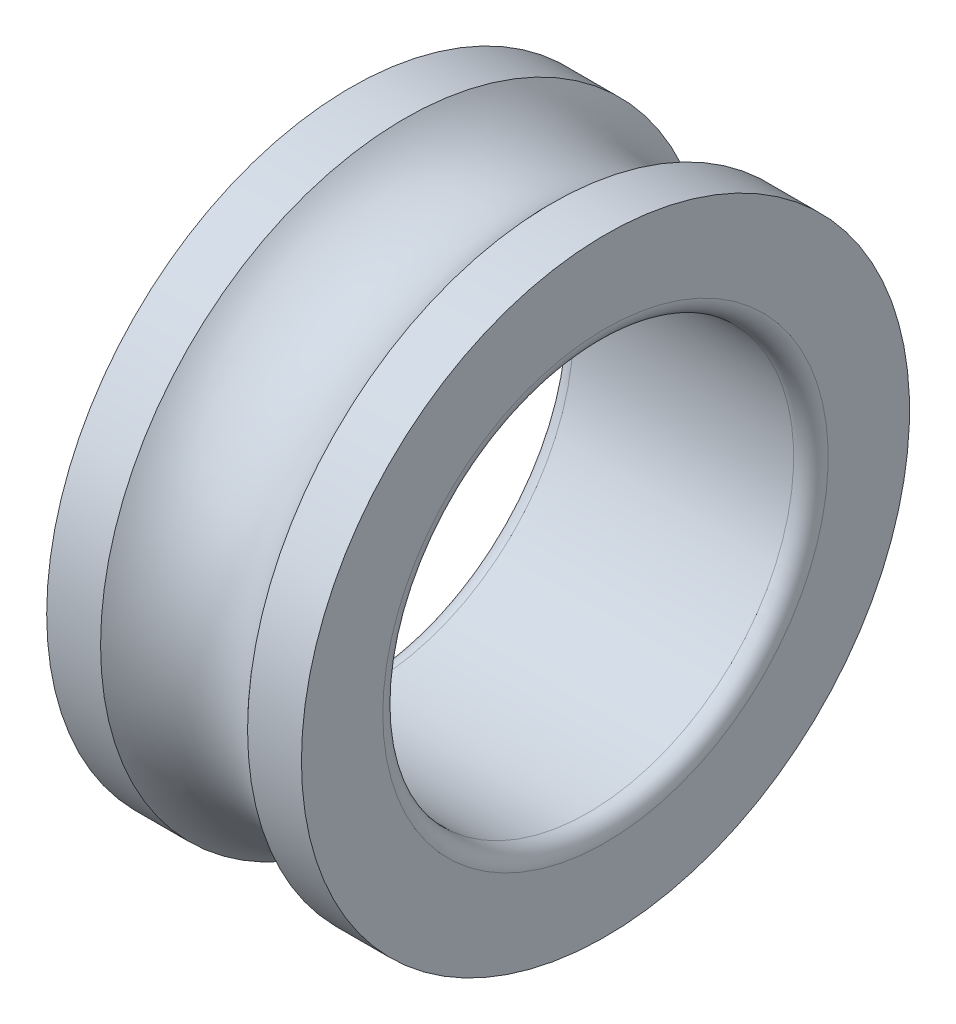
ISO-10303-21;
HEADER;
FILE_DESCRIPTION(('STEP AP214'),'2;1');
FILE_NAME('part.step','',(''),(''),'','','');
FILE_SCHEMA(('AUTOMOTIVE_DESIGN { 1 0 10303 214 1 1 1 1 }'));
ENDSEC;
DATA;
#1=APPLICATION_CONTEXT('core data for automotive mechanical design processes');
#2=APPLICATION_PROTOCOL_DEFINITION('international standard','automotive_design',2000,#1);
#3=PRODUCT_CONTEXT('',#1,'mechanical');
#4=PRODUCT('Part','Part','',(#3));
#5=PRODUCT_RELATED_PRODUCT_CATEGORY('part','',(#4));
#6=PRODUCT_DEFINITION_FORMATION('','',#4);
#7=PRODUCT_DEFINITION_CONTEXT('part definition',#1,'design');
#8=PRODUCT_DEFINITION('design','',#6,#7);
#9=PRODUCT_DEFINITION_SHAPE('','',#8);
#10=(LENGTH_UNIT() NAMED_UNIT(*) SI_UNIT(.MILLI.,.METRE.));
#11=(NAMED_UNIT(*) PLANE_ANGLE_UNIT() SI_UNIT($,.RADIAN.));
#12=(NAMED_UNIT(*) SI_UNIT($,.STERADIAN.) SOLID_ANGLE_UNIT());
#13=UNCERTAINTY_MEASURE_WITH_UNIT(LENGTH_MEASURE(1.E-05),#10,'distance_accuracy_value','');
#14=(GEOMETRIC_REPRESENTATION_CONTEXT(3) GLOBAL_UNCERTAINTY_ASSIGNED_CONTEXT((#13)) GLOBAL_UNIT_ASSIGNED_CONTEXT((#10,
#11,#12)) REPRESENTATION_CONTEXT('',''));
#15=CARTESIAN_POINT('',(0.,0.,0.));
#16=DIRECTION('',(0.,0.,1.));
#17=DIRECTION('',(1.,0.,0.));
#18=AXIS2_PLACEMENT_3D('',#15,#16,#17);
#19=CARTESIAN_POINT('',(-15.5,0.,0.));
#20=DIRECTION('',(-1.,0.,0.));
#21=DIRECTION('',(0.,0.,1.));
#22=AXIS2_PLACEMENT_3D('',#19,#20,#21);
#23=CYLINDRICAL_SURFACE('',#22,37.);
#24=CARTESIAN_POINT('',(-15.5,0.,0.));
#25=DIRECTION('',(-1.,0.,0.));
#26=DIRECTION('',(0.,0.,1.));
#27=AXIS2_PLACEMENT_3D('',#24,#25,#26);
#28=CIRCLE('',#27,37.);
#29=CARTESIAN_POINT('',(-15.5,0.,37.));
#30=VERTEX_POINT('',#29);
#31=EDGE_CURVE('E59',#30,#30,#28,.T.);
#32=ORIENTED_EDGE('',*,*,#31,.F.);
#33=EDGE_LOOP('',(#32));
#34=FACE_BOUND('',#33,.T.);
#35=CARTESIAN_POINT('',(-8.94427190999917,0.,0.));
#36=DIRECTION('',(-1.,0.,0.));
#37=DIRECTION('',(0.,0.,1.));
#38=AXIS2_PLACEMENT_3D('',#35,#36,#37);
#39=CIRCLE('',#38,37.);
#40=CARTESIAN_POINT('',(-8.94427190999917,0.,37.));
#41=VERTEX_POINT('',#40);
#42=EDGE_CURVE('E10',#41,#41,#39,.T.);
#43=ORIENTED_EDGE('',*,*,#42,.T.);
#44=EDGE_LOOP('',(#43));
#45=FACE_BOUND('',#44,.T.);
#46=ADVANCED_FACE('F31',(#34,#45),#23,.T.);
#47=CARTESIAN_POINT('',(0.,0.,0.));
#48=DIRECTION('',(-1.,0.,0.));
#49=DIRECTION('',(0.,0.,1.));
#50=AXIS2_PLACEMENT_3D('',#47,#48,#49);
#51=TOROIDAL_SURFACE('',#50,45.,12.);
#52=ORIENTED_EDGE('',*,*,#42,.F.);
#53=EDGE_LOOP('',(#52));
#54=FACE_BOUND('',#53,.T.);
#55=CARTESIAN_POINT('',(8.94427190999915,0.,0.));
#56=DIRECTION('',(-1.,0.,0.));
#57=DIRECTION('',(0.,0.,1.));
#58=AXIS2_PLACEMENT_3D('',#55,#56,#57);
#59=CIRCLE('',#58,37.);
#60=CARTESIAN_POINT('',(8.94427190999915,0.,37.));
#61=VERTEX_POINT('',#60);
#62=EDGE_CURVE('E37',#61,#61,#59,.T.);
#63=ORIENTED_EDGE('',*,*,#62,.T.);
#64=EDGE_LOOP('',(#63));
#65=FACE_BOUND('',#64,.T.);
#66=ADVANCED_FACE('F66',(#54,#65),#51,.F.);
#67=CARTESIAN_POINT('',(-15.5,0.,0.));
#68=DIRECTION('',(-1.,0.,0.));
#69=DIRECTION('',(0.,0.,1.));
#70=AXIS2_PLACEMENT_3D('',#67,#68,#69);
#71=CYLINDRICAL_SURFACE('',#70,37.);
#72=ORIENTED_EDGE('',*,*,#62,.F.);
#73=EDGE_LOOP('',(#72));
#74=FACE_BOUND('',#73,.T.);
#75=CARTESIAN_POINT('',(15.5,0.,0.));
#76=DIRECTION('',(-1.,0.,0.));
#77=DIRECTION('',(0.,0.,1.));
#78=AXIS2_PLACEMENT_3D('',#75,#76,#77);
#79=CIRCLE('',#78,37.);
#80=CARTESIAN_POINT('',(15.5,0.,37.));
#81=VERTEX_POINT('',#80);
#82=EDGE_CURVE('E41',#81,#81,#79,.T.);
#83=ORIENTED_EDGE('',*,*,#82,.T.);
#84=EDGE_LOOP('',(#83));
#85=FACE_BOUND('',#84,.T.);
#86=ADVANCED_FACE('F70',(#74,#85),#71,.T.);
#87=CARTESIAN_POINT('',(15.5,27.1,0.));
#88=DIRECTION('',(-1.,0.,0.));
#89=DIRECTION('',(0.,0.,1.));
#90=AXIS2_PLACEMENT_3D('',#87,#88,#89);
#91=PLANE('',#90);
#92=ORIENTED_EDGE('',*,*,#82,.F.);
#93=EDGE_LOOP('',(#92));
#94=FACE_BOUND('',#93,.T.);
#95=CARTESIAN_POINT('',(15.5,0.,0.));
#96=DIRECTION('',(-1.,0.,0.));
#97=DIRECTION('',(0.,0.,1.));
#98=AXIS2_PLACEMENT_3D('',#95,#96,#97);
#99=CIRCLE('',#98,27.1);
#100=CARTESIAN_POINT('',(15.5,0.,27.1));
#101=VERTEX_POINT('',#100);
#102=EDGE_CURVE('E45',#101,#101,#99,.T.);
#103=ORIENTED_EDGE('',*,*,#102,.T.);
#104=EDGE_LOOP('',(#103));
#105=FACE_BOUND('',#104,.T.);
#106=ADVANCED_FACE('F75',(#94,#105),#91,.F.);
#107=CARTESIAN_POINT('',(13.4,0.,0.));
#108=DIRECTION('',(-1.,0.,0.));
#109=DIRECTION('',(0.,0.,1.));
#110=AXIS2_PLACEMENT_3D('',#107,#108,#109);
#111=TOROIDAL_SURFACE('',#110,27.1,2.1);
#112=ORIENTED_EDGE('',*,*,#102,.F.);
#113=EDGE_LOOP('',(#112));
#114=FACE_BOUND('',#113,.T.);
#115=CARTESIAN_POINT('',(13.4,0.,0.));
#116=DIRECTION('',(-1.,0.,0.));
#117=DIRECTION('',(0.,0.,1.));
#118=AXIS2_PLACEMENT_3D('',#115,#116,#117);
#119=CIRCLE('',#118,25.);
#120=CARTESIAN_POINT('',(13.4,0.,25.));
#121=VERTEX_POINT('',#120);
#122=EDGE_CURVE('E50',#121,#121,#119,.T.);
#123=ORIENTED_EDGE('',*,*,#122,.T.);
#124=EDGE_LOOP('',(#123));
#125=FACE_BOUND('',#124,.T.);
#126=ADVANCED_FACE('F81',(#114,#125),#111,.T.);
#127=CARTESIAN_POINT('',(-15.5,0.,0.));
#128=DIRECTION('',(-1.,0.,0.));
#129=DIRECTION('',(0.,0.,1.));
#130=AXIS2_PLACEMENT_3D('',#127,#128,#129);
#131=CYLINDRICAL_SURFACE('',#130,25.);
#132=ORIENTED_EDGE('',*,*,#122,.F.);
#133=EDGE_LOOP('',(#132));
#134=FACE_BOUND('',#133,.T.);
#135=CARTESIAN_POINT('',(-13.4,0.,0.));
#136=DIRECTION('',(-1.,0.,0.));
#137=DIRECTION('',(0.,0.,1.));
#138=AXIS2_PLACEMENT_3D('',#135,#136,#137);
#139=CIRCLE('',#138,25.);
#140=CARTESIAN_POINT('',(-13.4,0.,25.));
#141=VERTEX_POINT('',#140);
#142=EDGE_CURVE('E53',#141,#141,#139,.T.);
#143=ORIENTED_EDGE('',*,*,#142,.T.);
#144=EDGE_LOOP('',(#143));
#145=FACE_BOUND('',#144,.T.);
#146=ADVANCED_FACE('F85',(#134,#145),#131,.F.);
#147=CARTESIAN_POINT('',(-13.4,0.,0.));
#148=DIRECTION('',(-1.,0.,0.));
#149=DIRECTION('',(0.,0.,1.));
#150=AXIS2_PLACEMENT_3D('',#147,#148,#149);
#151=TOROIDAL_SURFACE('',#150,27.1,2.1);
#152=ORIENTED_EDGE('',*,*,#142,.F.);
#153=EDGE_LOOP('',(#152));
#154=FACE_BOUND('',#153,.T.);
#155=CARTESIAN_POINT('',(-15.5,0.,0.));
#156=DIRECTION('',(-1.,0.,0.));
#157=DIRECTION('',(0.,0.,1.));
#158=AXIS2_PLACEMENT_3D('',#155,#156,#157);
#159=CIRCLE('',#158,27.1);
#160=CARTESIAN_POINT('',(-15.5,0.,27.1));
#161=VERTEX_POINT('',#160);
#162=EDGE_CURVE('E56',#161,#161,#159,.T.);
#163=ORIENTED_EDGE('',*,*,#162,.T.);
#164=EDGE_LOOP('',(#163));
#165=FACE_BOUND('',#164,.T.);
#166=ADVANCED_FACE('F89',(#154,#165),#151,.T.);
#167=CARTESIAN_POINT('',(-15.5,27.1,0.));
#168=DIRECTION('',(1.,0.,0.));
#169=DIRECTION('',(0.,0.,-1.));
#170=AXIS2_PLACEMENT_3D('',#167,#168,#169);
#171=PLANE('',#170);
#172=ORIENTED_EDGE('',*,*,#162,.F.);
#173=EDGE_LOOP('',(#172));
#174=FACE_BOUND('',#173,.T.);
#175=ORIENTED_EDGE('',*,*,#31,.T.);
#176=EDGE_LOOP('',(#175));
#177=FACE_BOUND('',#176,.T.);
#178=ADVANCED_FACE('F63',(#174,#177),#171,.F.);
#179=CLOSED_SHELL('',(#46,#66,#86,#106,#126,#146,#166,#178));
#180=MANIFOLD_SOLID_BREP('B2',#179);
#181=ADVANCED_BREP_SHAPE_REPRESENTATION('',(#18,#180),#14);
#182=SHAPE_DEFINITION_REPRESENTATION(#9,#181);
ENDSEC;
END-ISO-10303-21;
